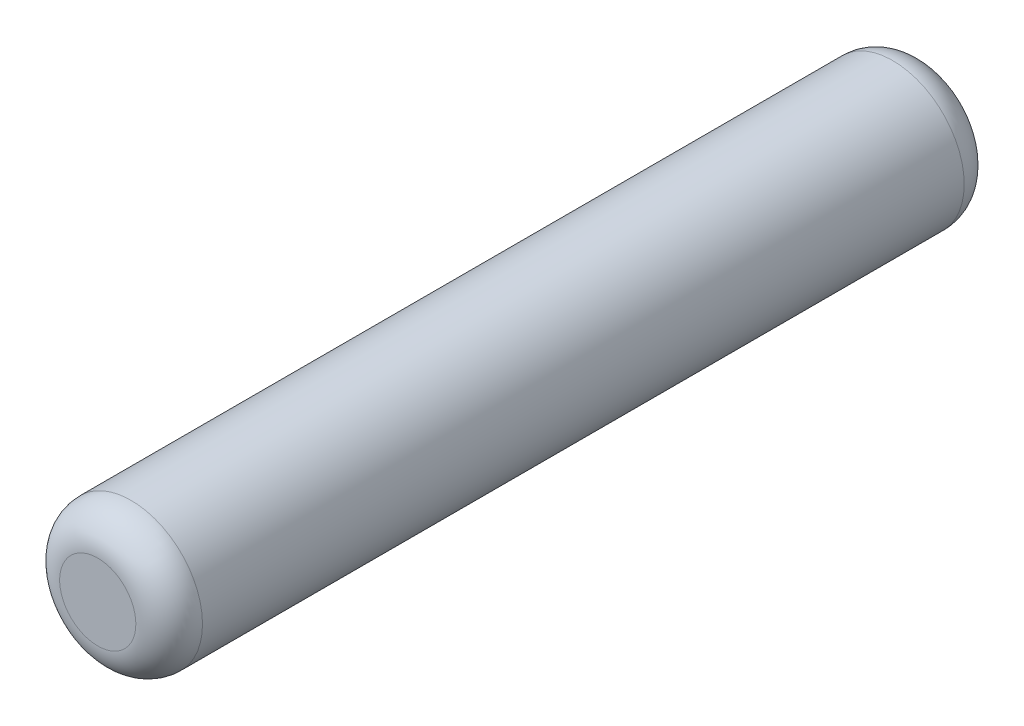
ISO-10303-21;
HEADER;
FILE_DESCRIPTION(('STEP AP214'),'2;1');
FILE_NAME('part.step','',(''),(''),'','','');
FILE_SCHEMA(('AUTOMOTIVE_DESIGN { 1 0 10303 214 1 1 1 1 }'));
ENDSEC;
DATA;
#1=APPLICATION_CONTEXT('core data for automotive mechanical design processes');
#2=APPLICATION_PROTOCOL_DEFINITION('international standard','automotive_design',2000,#1);
#3=PRODUCT_CONTEXT('',#1,'mechanical');
#4=PRODUCT('Part','Part','',(#3));
#5=PRODUCT_RELATED_PRODUCT_CATEGORY('part','',(#4));
#6=PRODUCT_DEFINITION_FORMATION('','',#4);
#7=PRODUCT_DEFINITION_CONTEXT('part definition',#1,'design');
#8=PRODUCT_DEFINITION('design','',#6,#7);
#9=PRODUCT_DEFINITION_SHAPE('','',#8);
#10=(LENGTH_UNIT() NAMED_UNIT(*) SI_UNIT(.MILLI.,.METRE.));
#11=(NAMED_UNIT(*) PLANE_ANGLE_UNIT() SI_UNIT($,.RADIAN.));
#12=(NAMED_UNIT(*) SI_UNIT($,.STERADIAN.) SOLID_ANGLE_UNIT());
#13=UNCERTAINTY_MEASURE_WITH_UNIT(LENGTH_MEASURE(1.E-05),#10,'distance_accuracy_value','');
#14=(GEOMETRIC_REPRESENTATION_CONTEXT(3) GLOBAL_UNCERTAINTY_ASSIGNED_CONTEXT((#13)) GLOBAL_UNIT_ASSIGNED_CONTEXT((#10,
#11,#12)) REPRESENTATION_CONTEXT('',''));
#15=CARTESIAN_POINT('',(0.,0.,0.));
#16=DIRECTION('',(0.,0.,1.));
#17=DIRECTION('',(1.,0.,0.));
#18=AXIS2_PLACEMENT_3D('',#15,#16,#17);
#19=CARTESIAN_POINT('',(0.,0.,4.35));
#20=DIRECTION('',(0.,0.,-1.));
#21=DIRECTION('',(-1.,0.,0.));
#22=AXIS2_PLACEMENT_3D('',#19,#20,#21);
#23=CYLINDRICAL_SURFACE('',#22,0.75);
#24=CARTESIAN_POINT('',(0.,0.,-4.));
#25=DIRECTION('',(0.,0.,1.));
#26=DIRECTION('',(1.,0.,0.));
#27=AXIS2_PLACEMENT_3D('',#24,#25,#26);
#28=CIRCLE('',#27,0.75);
#29=CARTESIAN_POINT('',(0.75,0.,-4.));
#30=VERTEX_POINT('',#29);
#31=EDGE_CURVE('E42',#30,#30,#28,.T.);
#32=ORIENTED_EDGE('',*,*,#31,.T.);
#33=EDGE_LOOP('',(#32));
#34=FACE_BOUND('',#33,.T.);
#35=CARTESIAN_POINT('',(0.,0.,4.));
#36=DIRECTION('',(0.,0.,1.));
#37=DIRECTION('',(1.,0.,0.));
#38=AXIS2_PLACEMENT_3D('',#35,#36,#37);
#39=CIRCLE('',#38,0.75);
#40=CARTESIAN_POINT('',(0.75,0.,4.));
#41=VERTEX_POINT('',#40);
#42=EDGE_CURVE('E46',#41,#41,#39,.F.);
#43=ORIENTED_EDGE('',*,*,#42,.T.);
#44=EDGE_LOOP('',(#43));
#45=FACE_BOUND('',#44,.T.);
#46=ADVANCED_FACE('F31',(#34,#45),#23,.T.);
#47=CARTESIAN_POINT('',(0.,0.,4.35));
#48=DIRECTION('',(0.,0.,1.));
#49=DIRECTION('',(1.,0.,0.));
#50=AXIS2_PLACEMENT_3D('',#47,#48,#49);
#51=PLANE('',#50);
#52=CARTESIAN_POINT('',(0.,0.,4.35));
#53=DIRECTION('',(0.,0.,1.));
#54=DIRECTION('',(1.,0.,0.));
#55=AXIS2_PLACEMENT_3D('',#52,#53,#54);
#56=CIRCLE('',#55,0.4);
#57=CARTESIAN_POINT('',(0.4,0.,4.35));
#58=VERTEX_POINT('',#57);
#59=EDGE_CURVE('E10',#58,#58,#56,.T.);
#60=ORIENTED_EDGE('',*,*,#59,.T.);
#61=EDGE_LOOP('',(#60));
#62=FACE_BOUND('',#61,.T.);
#63=ADVANCED_FACE('F62',(#62),#51,.T.);
#64=CARTESIAN_POINT('',(0.,0.,-4.35));
#65=DIRECTION('',(0.,0.,1.));
#66=DIRECTION('',(1.,0.,0.));
#67=AXIS2_PLACEMENT_3D('',#64,#65,#66);
#68=PLANE('',#67);
#69=CARTESIAN_POINT('',(0.,0.,-4.35));
#70=DIRECTION('',(0.,0.,1.));
#71=DIRECTION('',(1.,0.,0.));
#72=AXIS2_PLACEMENT_3D('',#69,#70,#71);
#73=CIRCLE('',#72,0.4);
#74=CARTESIAN_POINT('',(0.4,0.,-4.35));
#75=VERTEX_POINT('',#74);
#76=EDGE_CURVE('E38',#75,#75,#73,.F.);
#77=ORIENTED_EDGE('',*,*,#76,.T.);
#78=EDGE_LOOP('',(#77));
#79=FACE_BOUND('',#78,.T.);
#80=ADVANCED_FACE('F59',(#79),#68,.F.);
#81=CARTESIAN_POINT('',(0.,0.,-4.));
#82=DIRECTION('',(0.,0.,1.));
#83=DIRECTION('',(1.,0.,0.));
#84=AXIS2_PLACEMENT_3D('',#81,#82,#83);
#85=TOROIDAL_SURFACE('',#84,0.4,0.35);
#86=ORIENTED_EDGE('',*,*,#76,.F.);
#87=EDGE_LOOP('',(#86));
#88=FACE_BOUND('',#87,.T.);
#89=ORIENTED_EDGE('',*,*,#31,.F.);
#90=EDGE_LOOP('',(#89));
#91=FACE_BOUND('',#90,.T.);
#92=ADVANCED_FACE('F55',(#88,#91),#85,.T.);
#93=CARTESIAN_POINT('',(0.,0.,4.));
#94=DIRECTION('',(0.,0.,1.));
#95=DIRECTION('',(1.,0.,0.));
#96=AXIS2_PLACEMENT_3D('',#93,#94,#95);
#97=TOROIDAL_SURFACE('',#96,0.4,0.35);
#98=ORIENTED_EDGE('',*,*,#42,.F.);
#99=EDGE_LOOP('',(#98));
#100=FACE_BOUND('',#99,.T.);
#101=ORIENTED_EDGE('',*,*,#59,.F.);
#102=EDGE_LOOP('',(#101));
#103=FACE_BOUND('',#102,.T.);
#104=ADVANCED_FACE('F33',(#100,#103),#97,.T.);
#105=CLOSED_SHELL('',(#46,#63,#80,#92,#104));
#106=MANIFOLD_SOLID_BREP('B2',#105);
#107=ADVANCED_BREP_SHAPE_REPRESENTATION('',(#18,#106),#14);
#108=SHAPE_DEFINITION_REPRESENTATION(#9,#107);
ENDSEC;
END-ISO-10303-21;
